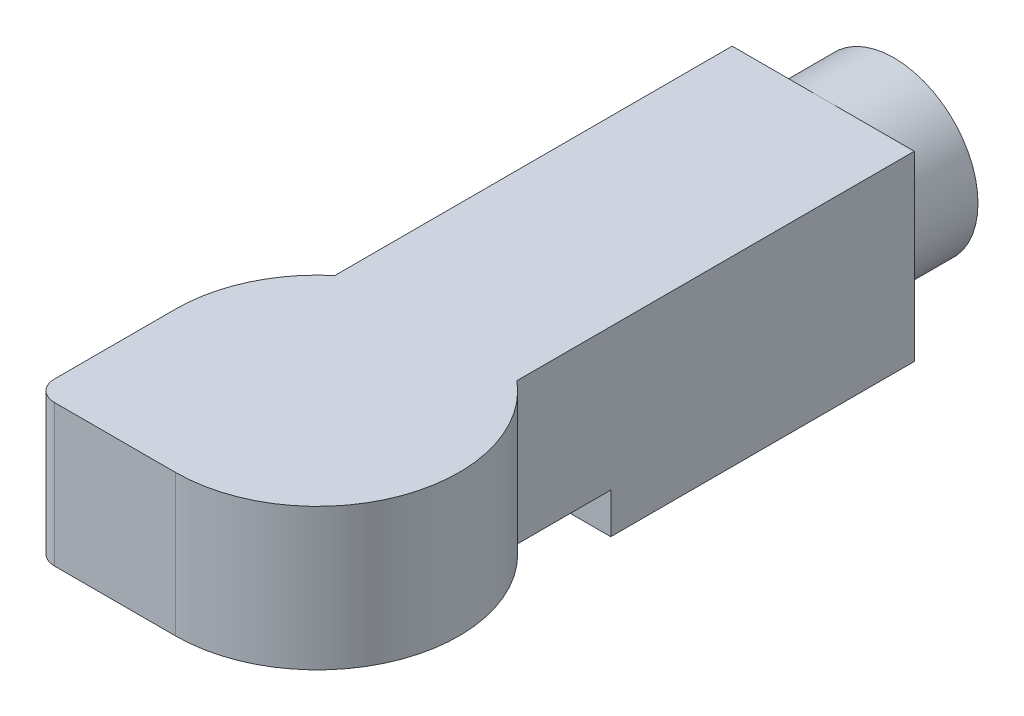
ISO-10303-21;
HEADER;
FILE_DESCRIPTION(('STEP AP214'),'2;1');
FILE_NAME('part.step','',(''),(''),'','','');
FILE_SCHEMA(('AUTOMOTIVE_DESIGN { 1 0 10303 214 1 1 1 1 }'));
ENDSEC;
DATA;
#1=APPLICATION_CONTEXT('core data for automotive mechanical design processes');
#2=APPLICATION_PROTOCOL_DEFINITION('international standard','automotive_design',2000,#1);
#3=PRODUCT_CONTEXT('',#1,'mechanical');
#4=PRODUCT('Part','Part','',(#3));
#5=PRODUCT_RELATED_PRODUCT_CATEGORY('part','',(#4));
#6=PRODUCT_DEFINITION_FORMATION('','',#4);
#7=PRODUCT_DEFINITION_CONTEXT('part definition',#1,'design');
#8=PRODUCT_DEFINITION('design','',#6,#7);
#9=PRODUCT_DEFINITION_SHAPE('','',#8);
#10=(LENGTH_UNIT() NAMED_UNIT(*) SI_UNIT(.MILLI.,.METRE.));
#11=(NAMED_UNIT(*) PLANE_ANGLE_UNIT() SI_UNIT($,.RADIAN.));
#12=(NAMED_UNIT(*) SI_UNIT($,.STERADIAN.) SOLID_ANGLE_UNIT());
#13=UNCERTAINTY_MEASURE_WITH_UNIT(LENGTH_MEASURE(1.E-05),#10,'distance_accuracy_value','');
#14=(GEOMETRIC_REPRESENTATION_CONTEXT(3) GLOBAL_UNCERTAINTY_ASSIGNED_CONTEXT((#13)) GLOBAL_UNIT_ASSIGNED_CONTEXT((#10,
#11,#12)) REPRESENTATION_CONTEXT('',''));
#15=CARTESIAN_POINT('',(0.,0.,0.));
#16=DIRECTION('',(0.,0.,1.));
#17=DIRECTION('',(1.,0.,0.));
#18=AXIS2_PLACEMENT_3D('',#15,#16,#17);
#19=CARTESIAN_POINT('',(45.,20.,-75.));
#20=DIRECTION('',(-1.,0.,0.));
#21=DIRECTION('',(0.,0.,1.));
#22=AXIS2_PLACEMENT_3D('',#19,#20,#21);
#23=PLANE('',#22);
#24=DIRECTION('',(0.,0.,-1.));
#25=VECTOR('',#24,1.);
#26=CARTESIAN_POINT('',(45.,0.,-75.));
#27=LINE('',#26,#25);
#28=CARTESIAN_POINT('',(45.,0.,75.));
#29=VERTEX_POINT('',#28);
#30=CARTESIAN_POINT('',(45.,0.,-75.));
#31=VERTEX_POINT('',#30);
#32=EDGE_CURVE('E171',#29,#31,#27,.T.);
#33=ORIENTED_EDGE('',*,*,#32,.T.);
#34=DIRECTION('',(0.,-1.,0.));
#35=VECTOR('',#34,1.);
#36=CARTESIAN_POINT('',(45.,20.,-75.));
#37=LINE('',#36,#35);
#38=CARTESIAN_POINT('',(45.,90.,-75.));
#39=VERTEX_POINT('',#38);
#40=EDGE_CURVE('E190',#39,#31,#37,.T.);
#41=ORIENTED_EDGE('',*,*,#40,.F.);
#42=DIRECTION('',(0.,0.,-1.));
#43=VECTOR('',#42,1.);
#44=CARTESIAN_POINT('',(45.,90.,-75.));
#45=LINE('',#44,#43);
#46=CARTESIAN_POINT('',(45.0000000000001,90.,121.380973526182));
#47=VERTEX_POINT('',#46);
#48=EDGE_CURVE('E129',#47,#39,#45,.T.);
#49=ORIENTED_EDGE('',*,*,#48,.F.);
#50=DIRECTION('',(0.,-1.,0.));
#51=VECTOR('',#50,1.);
#52=CARTESIAN_POINT('',(45.0000000000001,90.,121.380973526182));
#53=LINE('',#52,#51);
#54=CARTESIAN_POINT('',(45.0000000000001,20.,121.380973526182));
#55=VERTEX_POINT('',#54);
#56=EDGE_CURVE('E133',#47,#55,#53,.T.);
#57=ORIENTED_EDGE('',*,*,#56,.T.);
#58=DIRECTION('',(0.,0.,-1.));
#59=VECTOR('',#58,1.);
#60=CARTESIAN_POINT('',(45.,20.,-75.));
#61=LINE('',#60,#59);
#62=CARTESIAN_POINT('',(45.,20.,75.));
#63=VERTEX_POINT('',#62);
#64=EDGE_CURVE('E156',#55,#63,#61,.T.);
#65=ORIENTED_EDGE('',*,*,#64,.T.);
#66=DIRECTION('',(0.,-1.,0.));
#67=VECTOR('',#66,1.);
#68=CARTESIAN_POINT('',(45.,20.,75.));
#69=LINE('',#68,#67);
#70=EDGE_CURVE('E175',#63,#29,#69,.T.);
#71=ORIENTED_EDGE('',*,*,#70,.T.);
#72=EDGE_LOOP('',(#33,#41,#49,#57,#65,#71));
#73=FACE_BOUND('',#72,.T.);
#74=ADVANCED_FACE('F42',(#73),#23,.F.);
#75=CARTESIAN_POINT('',(-45.,20.,-75.));
#76=DIRECTION('',(0.,0.,1.));
#77=DIRECTION('',(1.,0.,0.));
#78=AXIS2_PLACEMENT_3D('',#75,#76,#77);
#79=PLANE('',#78);
#80=DIRECTION('',(-1.,0.,0.));
#81=VECTOR('',#80,1.);
#82=CARTESIAN_POINT('',(-45.,90.,-75.));
#83=LINE('',#82,#81);
#84=CARTESIAN_POINT('',(0.,90.,-75.));
#85=VERTEX_POINT('',#84);
#86=CARTESIAN_POINT('',(-45.,90.,-75.));
#87=VERTEX_POINT('',#86);
#88=EDGE_CURVE('E126',#85,#87,#83,.T.);
#89=ORIENTED_EDGE('',*,*,#88,.F.);
#90=CARTESIAN_POINT('',(0.,48.5,-75.));
#91=DIRECTION('',(0.,0.,-1.));
#92=DIRECTION('',(-1.,0.,0.));
#93=AXIS2_PLACEMENT_3D('',#90,#91,#92);
#94=CIRCLE('',#93,41.5);
#95=EDGE_CURVE('E137',#85,#85,#94,.T.);
#96=ORIENTED_EDGE('',*,*,#95,.F.);
#97=EDGE_CURVE('E122',#39,#85,#83,.T.);
#98=ORIENTED_EDGE('',*,*,#97,.F.);
#99=ORIENTED_EDGE('',*,*,#40,.T.);
#100=DIRECTION('',(-1.,0.,0.));
#101=VECTOR('',#100,1.);
#102=CARTESIAN_POINT('',(-45.,0.,-75.));
#103=LINE('',#102,#101);
#104=CARTESIAN_POINT('',(-45.,0.,-75.));
#105=VERTEX_POINT('',#104);
#106=EDGE_CURVE('E179',#31,#105,#103,.T.);
#107=ORIENTED_EDGE('',*,*,#106,.T.);
#108=DIRECTION('',(0.,-1.,0.));
#109=VECTOR('',#108,1.);
#110=CARTESIAN_POINT('',(-45.,20.,-75.));
#111=LINE('',#110,#109);
#112=EDGE_CURVE('E139',#87,#105,#111,.T.);
#113=ORIENTED_EDGE('',*,*,#112,.F.);
#114=EDGE_LOOP('',(#89,#96,#98,#99,#107,#113));
#115=FACE_BOUND('',#114,.T.);
#116=ADVANCED_FACE('F135',(#115),#79,.F.);
#117=CARTESIAN_POINT('',(-45.,20.,-75.));
#118=DIRECTION('',(1.,0.,0.));
#119=DIRECTION('',(0.,0.,-1.));
#120=AXIS2_PLACEMENT_3D('',#117,#118,#119);
#121=PLANE('',#120);
#122=DIRECTION('',(0.,0.,1.));
#123=VECTOR('',#122,1.);
#124=CARTESIAN_POINT('',(-45.,0.,-75.));
#125=LINE('',#124,#123);
#126=CARTESIAN_POINT('',(-45.,0.,75.));
#127=VERTEX_POINT('',#126);
#128=EDGE_CURVE('E181',#105,#127,#125,.T.);
#129=ORIENTED_EDGE('',*,*,#128,.T.);
#130=DIRECTION('',(0.,-1.,0.));
#131=VECTOR('',#130,1.);
#132=CARTESIAN_POINT('',(-45.,20.,75.));
#133=LINE('',#132,#131);
#134=CARTESIAN_POINT('',(-45.,20.,75.));
#135=VERTEX_POINT('',#134);
#136=EDGE_CURVE('E186',#135,#127,#133,.T.);
#137=ORIENTED_EDGE('',*,*,#136,.F.);
#138=DIRECTION('',(0.,0.,1.));
#139=VECTOR('',#138,1.);
#140=CARTESIAN_POINT('',(-45.,20.,-75.));
#141=LINE('',#140,#139);
#142=CARTESIAN_POINT('',(-44.9999999999999,20.,121.380973526182));
#143=VERTEX_POINT('',#142);
#144=EDGE_CURVE('E145',#135,#143,#141,.T.);
#145=ORIENTED_EDGE('',*,*,#144,.T.);
#146=DIRECTION('',(0.,-1.,0.));
#147=VECTOR('',#146,1.);
#148=CARTESIAN_POINT('',(-44.9999999999999,90.,121.380973526182));
#149=LINE('',#148,#147);
#150=CARTESIAN_POINT('',(-44.9999999999999,90.,121.380973526182));
#151=VERTEX_POINT('',#150);
#152=EDGE_CURVE('E168',#151,#143,#149,.T.);
#153=ORIENTED_EDGE('',*,*,#152,.F.);
#154=DIRECTION('',(0.,0.,1.));
#155=VECTOR('',#154,1.);
#156=CARTESIAN_POINT('',(-45.,90.,-75.));
#157=LINE('',#156,#155);
#158=EDGE_CURVE('E159',#87,#151,#157,.T.);
#159=ORIENTED_EDGE('',*,*,#158,.F.);
#160=ORIENTED_EDGE('',*,*,#112,.T.);
#161=EDGE_LOOP('',(#129,#137,#145,#153,#159,#160));
#162=FACE_BOUND('',#161,.T.);
#163=ADVANCED_FACE('F215',(#162),#121,.F.);
#164=CARTESIAN_POINT('',(-45.,20.,75.));
#165=DIRECTION('',(0.,0.,-1.));
#166=DIRECTION('',(-1.,0.,0.));
#167=AXIS2_PLACEMENT_3D('',#164,#165,#166);
#168=PLANE('',#167);
#169=DIRECTION('',(1.,0.,0.));
#170=VECTOR('',#169,1.);
#171=CARTESIAN_POINT('',(-45.,0.,75.));
#172=LINE('',#171,#170);
#173=EDGE_CURVE('E176',#127,#29,#172,.T.);
#174=ORIENTED_EDGE('',*,*,#173,.T.);
#175=ORIENTED_EDGE('',*,*,#70,.F.);
#176=DIRECTION('',(1.,0.,0.));
#177=VECTOR('',#176,1.);
#178=CARTESIAN_POINT('',(-45.,20.,75.));
#179=LINE('',#178,#177);
#180=EDGE_CURVE('E172',#135,#63,#179,.T.);
#181=ORIENTED_EDGE('',*,*,#180,.F.);
#182=ORIENTED_EDGE('',*,*,#136,.T.);
#183=EDGE_LOOP('',(#174,#175,#181,#182));
#184=FACE_BOUND('',#183,.T.);
#185=ADVANCED_FACE('F220',(#184),#168,.F.);
#186=CARTESIAN_POINT('',(0.,0.,0.));
#187=DIRECTION('',(0.,1.,0.));
#188=DIRECTION('',(0.,0.,1.));
#189=AXIS2_PLACEMENT_3D('',#186,#187,#188);
#190=PLANE('',#189);
#191=ORIENTED_EDGE('',*,*,#32,.F.);
#192=ORIENTED_EDGE('',*,*,#173,.F.);
#193=ORIENTED_EDGE('',*,*,#128,.F.);
#194=ORIENTED_EDGE('',*,*,#106,.F.);
#195=EDGE_LOOP('',(#191,#192,#193,#194));
#196=FACE_BOUND('',#195,.T.);
#197=ADVANCED_FACE('F218',(#196),#190,.F.);
#198=CARTESIAN_POINT('',(0.,20.,175.));
#199=DIRECTION('',(0.,1.,0.));
#200=DIRECTION('',(0.,0.,1.));
#201=AXIS2_PLACEMENT_3D('',#198,#199,#200);
#202=PLANE('',#201);
#203=DIRECTION('',(1.,0.,0.));
#204=VECTOR('',#203,1.);
#205=CARTESIAN_POINT('',(-69.9999999999999,20.,245.));
#206=LINE('',#205,#204);
#207=CARTESIAN_POINT('',(-59.9999999999999,20.,245.));
#208=VERTEX_POINT('',#207);
#209=CARTESIAN_POINT('',(0.,20.,245.));
#210=VERTEX_POINT('',#209);
#211=EDGE_CURVE('E152',#208,#210,#206,.T.);
#212=ORIENTED_EDGE('',*,*,#211,.F.);
#213=CARTESIAN_POINT('',(-59.9999999999999,20.,235.));
#214=DIRECTION('',(0.,1.,0.));
#215=DIRECTION('',(0.,0.,1.));
#216=AXIS2_PLACEMENT_3D('',#213,#214,#215);
#217=CIRCLE('',#216,10.);
#218=CARTESIAN_POINT('',(-69.9999999999999,20.,235.));
#219=VERTEX_POINT('',#218);
#220=EDGE_CURVE('E64',#208,#219,#217,.F.);
#221=ORIENTED_EDGE('',*,*,#220,.T.);
#222=DIRECTION('',(0.,0.,1.));
#223=VECTOR('',#222,1.);
#224=CARTESIAN_POINT('',(-69.9999999999999,20.,175.));
#225=LINE('',#224,#223);
#226=CARTESIAN_POINT('',(-69.9999999999999,20.,175.));
#227=VERTEX_POINT('',#226);
#228=EDGE_CURVE('E150',#227,#219,#225,.T.);
#229=ORIENTED_EDGE('',*,*,#228,.F.);
#230=CARTESIAN_POINT('',(0.,20.,175.));
#231=DIRECTION('',(0.,1.,0.));
#232=DIRECTION('',(0.,0.,1.));
#233=AXIS2_PLACEMENT_3D('',#230,#231,#232);
#234=CIRCLE('',#233,70.);
#235=EDGE_CURVE('E147',#143,#227,#234,.T.);
#236=ORIENTED_EDGE('',*,*,#235,.F.);
#237=ORIENTED_EDGE('',*,*,#144,.F.);
#238=ORIENTED_EDGE('',*,*,#180,.T.);
#239=ORIENTED_EDGE('',*,*,#64,.F.);
#240=CARTESIAN_POINT('',(0.,20.,175.));
#241=DIRECTION('',(0.,1.,0.));
#242=DIRECTION('',(0.,0.,1.));
#243=AXIS2_PLACEMENT_3D('',#240,#241,#242);
#244=CIRCLE('',#243,70.);
#245=EDGE_CURVE('E154',#210,#55,#244,.T.);
#246=ORIENTED_EDGE('',*,*,#245,.F.);
#247=EDGE_LOOP('',(#212,#221,#229,#236,#237,#238,#239,#246));
#248=FACE_BOUND('',#247,.T.);
#249=ADVANCED_FACE('F204',(#248),#202,.F.);
#250=CARTESIAN_POINT('',(0.,90.,175.));
#251=DIRECTION('',(0.,-1.,0.));
#252=DIRECTION('',(0.,0.,-1.));
#253=AXIS2_PLACEMENT_3D('',#250,#251,#252);
#254=CYLINDRICAL_SURFACE('',#253,70.);
#255=ORIENTED_EDGE('',*,*,#235,.T.);
#256=DIRECTION('',(0.,-1.,0.));
#257=VECTOR('',#256,1.);
#258=CARTESIAN_POINT('',(-69.9999999999999,90.,175.));
#259=LINE('',#258,#257);
#260=CARTESIAN_POINT('',(-69.9999999999999,90.,175.));
#261=VERTEX_POINT('',#260);
#262=EDGE_CURVE('E165',#261,#227,#259,.T.);
#263=ORIENTED_EDGE('',*,*,#262,.F.);
#264=CARTESIAN_POINT('',(0.,90.,175.));
#265=DIRECTION('',(0.,1.,0.));
#266=DIRECTION('',(0.,0.,1.));
#267=AXIS2_PLACEMENT_3D('',#264,#265,#266);
#268=CIRCLE('',#267,70.);
#269=EDGE_CURVE('E227',#151,#261,#268,.T.);
#270=ORIENTED_EDGE('',*,*,#269,.F.);
#271=ORIENTED_EDGE('',*,*,#152,.T.);
#272=EDGE_LOOP('',(#255,#263,#270,#271));
#273=FACE_BOUND('',#272,.T.);
#274=ADVANCED_FACE('F226',(#273),#254,.T.);
#275=CARTESIAN_POINT('',(-69.9999999999999,90.,175.));
#276=DIRECTION('',(1.,0.,0.));
#277=DIRECTION('',(0.,0.,-1.));
#278=AXIS2_PLACEMENT_3D('',#275,#276,#277);
#279=PLANE('',#278);
#280=ORIENTED_EDGE('',*,*,#228,.T.);
#281=DIRECTION('',(0.,-1.,0.));
#282=VECTOR('',#281,1.);
#283=CARTESIAN_POINT('',(-69.9999999999999,90.,235.));
#284=LINE('',#283,#282);
#285=CARTESIAN_POINT('',(-69.9999999999999,90.,235.));
#286=VERTEX_POINT('',#285);
#287=EDGE_CURVE('E50',#219,#286,#284,.F.);
#288=ORIENTED_EDGE('',*,*,#287,.T.);
#289=DIRECTION('',(0.,0.,1.));
#290=VECTOR('',#289,1.);
#291=CARTESIAN_POINT('',(-69.9999999999999,90.,175.));
#292=LINE('',#291,#290);
#293=EDGE_CURVE('E228',#261,#286,#292,.T.);
#294=ORIENTED_EDGE('',*,*,#293,.F.);
#295=ORIENTED_EDGE('',*,*,#262,.T.);
#296=EDGE_LOOP('',(#280,#288,#294,#295));
#297=FACE_BOUND('',#296,.T.);
#298=ADVANCED_FACE('F260',(#297),#279,.F.);
#299=CARTESIAN_POINT('',(-69.9999999999999,90.,245.));
#300=DIRECTION('',(0.,0.,-1.));
#301=DIRECTION('',(-1.,0.,0.));
#302=AXIS2_PLACEMENT_3D('',#299,#300,#301);
#303=PLANE('',#302);
#304=DIRECTION('',(1.,0.,0.));
#305=VECTOR('',#304,1.);
#306=CARTESIAN_POINT('',(-69.9999999999999,90.,245.));
#307=LINE('',#306,#305);
#308=CARTESIAN_POINT('',(-59.9999999999999,90.,245.));
#309=VERTEX_POINT('',#308);
#310=CARTESIAN_POINT('',(0.,90.,245.));
#311=VERTEX_POINT('',#310);
#312=EDGE_CURVE('E200',#309,#311,#307,.T.);
#313=ORIENTED_EDGE('',*,*,#312,.F.);
#314=DIRECTION('',(0.,-1.,0.));
#315=VECTOR('',#314,1.);
#316=CARTESIAN_POINT('',(-59.9999999999999,90.,245.));
#317=LINE('',#316,#315);
#318=EDGE_CURVE('E192',#309,#208,#317,.T.);
#319=ORIENTED_EDGE('',*,*,#318,.T.);
#320=ORIENTED_EDGE('',*,*,#211,.T.);
#321=DIRECTION('',(0.,-1.,0.));
#322=VECTOR('',#321,1.);
#323=CARTESIAN_POINT('',(0.,90.,245.));
#324=LINE('',#323,#322);
#325=EDGE_CURVE('E162',#311,#210,#324,.T.);
#326=ORIENTED_EDGE('',*,*,#325,.F.);
#327=EDGE_LOOP('',(#313,#319,#320,#326));
#328=FACE_BOUND('',#327,.T.);
#329=ADVANCED_FACE('F198',(#328),#303,.F.);
#330=CARTESIAN_POINT('',(0.,90.,175.));
#331=DIRECTION('',(0.,-1.,0.));
#332=DIRECTION('',(0.,0.,-1.));
#333=AXIS2_PLACEMENT_3D('',#330,#331,#332);
#334=CYLINDRICAL_SURFACE('',#333,70.);
#335=ORIENTED_EDGE('',*,*,#245,.T.);
#336=ORIENTED_EDGE('',*,*,#56,.F.);
#337=CARTESIAN_POINT('',(0.,90.,175.));
#338=DIRECTION('',(0.,1.,0.));
#339=DIRECTION('',(0.,0.,1.));
#340=AXIS2_PLACEMENT_3D('',#337,#338,#339);
#341=CIRCLE('',#340,70.);
#342=EDGE_CURVE('E141',#311,#47,#341,.T.);
#343=ORIENTED_EDGE('',*,*,#342,.F.);
#344=ORIENTED_EDGE('',*,*,#325,.T.);
#345=EDGE_LOOP('',(#335,#336,#343,#344));
#346=FACE_BOUND('',#345,.T.);
#347=ADVANCED_FACE('F208',(#346),#334,.T.);
#348=CARTESIAN_POINT('',(0.,90.,175.));
#349=DIRECTION('',(0.,1.,0.));
#350=DIRECTION('',(0.,0.,1.));
#351=AXIS2_PLACEMENT_3D('',#348,#349,#350);
#352=PLANE('',#351);
#353=ORIENTED_EDGE('',*,*,#293,.T.);
#354=CARTESIAN_POINT('',(-59.9999999999999,90.,235.));
#355=DIRECTION('',(0.,1.,0.));
#356=DIRECTION('',(0.,0.,1.));
#357=AXIS2_PLACEMENT_3D('',#354,#355,#356);
#358=CIRCLE('',#357,10.);
#359=EDGE_CURVE('E11',#286,#309,#358,.T.);
#360=ORIENTED_EDGE('',*,*,#359,.T.);
#361=ORIENTED_EDGE('',*,*,#312,.T.);
#362=ORIENTED_EDGE('',*,*,#342,.T.);
#363=ORIENTED_EDGE('',*,*,#48,.T.);
#364=ORIENTED_EDGE('',*,*,#97,.T.);
#365=ORIENTED_EDGE('',*,*,#88,.T.);
#366=ORIENTED_EDGE('',*,*,#158,.T.);
#367=ORIENTED_EDGE('',*,*,#269,.T.);
#368=EDGE_LOOP('',(#353,#360,#361,#362,#363,#364,#365,#366,#367));
#369=FACE_BOUND('',#368,.T.);
#370=ADVANCED_FACE('F124',(#369),#352,.T.);
#371=CARTESIAN_POINT('',(-59.9999999999999,90.,235.));
#372=DIRECTION('',(0.,-1.,0.));
#373=DIRECTION('',(0.,0.,-1.));
#374=AXIS2_PLACEMENT_3D('',#371,#372,#373);
#375=CYLINDRICAL_SURFACE('',#374,10.);
#376=ORIENTED_EDGE('',*,*,#359,.F.);
#377=ORIENTED_EDGE('',*,*,#287,.F.);
#378=ORIENTED_EDGE('',*,*,#220,.F.);
#379=ORIENTED_EDGE('',*,*,#318,.F.);
#380=EDGE_LOOP('',(#376,#377,#378,#379));
#381=FACE_BOUND('',#380,.T.);
#382=ADVANCED_FACE('F44',(#381),#375,.T.);
#383=CARTESIAN_POINT('',(0.,48.5,-110.));
#384=DIRECTION('',(0.,0.,1.));
#385=DIRECTION('',(1.,0.,0.));
#386=AXIS2_PLACEMENT_3D('',#383,#384,#385);
#387=CYLINDRICAL_SURFACE('',#386,41.5);
#388=CARTESIAN_POINT('',(0.,48.5,-110.));
#389=DIRECTION('',(0.,0.,-1.));
#390=DIRECTION('',(-1.,0.,0.));
#391=AXIS2_PLACEMENT_3D('',#388,#389,#390);
#392=CIRCLE('',#391,41.5);
#393=CARTESIAN_POINT('',(-41.4999999999999,48.5,-110.));
#394=VERTEX_POINT('',#393);
#395=EDGE_CURVE('E148',#394,#394,#392,.T.);
#396=ORIENTED_EDGE('',*,*,#395,.F.);
#397=EDGE_LOOP('',(#396));
#398=FACE_BOUND('',#397,.T.);
#399=ORIENTED_EDGE('',*,*,#95,.T.);
#400=EDGE_LOOP('',(#399));
#401=FACE_BOUND('',#400,.T.);
#402=ADVANCED_FACE('F236',(#398,#401),#387,.T.);
#403=CARTESIAN_POINT('',(0.,48.5,-110.));
#404=DIRECTION('',(0.,0.,-1.));
#405=DIRECTION('',(-1.,0.,0.));
#406=AXIS2_PLACEMENT_3D('',#403,#404,#405);
#407=PLANE('',#406);
#408=ORIENTED_EDGE('',*,*,#395,.T.);
#409=EDGE_LOOP('',(#408));
#410=FACE_BOUND('',#409,.T.);
#411=ADVANCED_FACE('F242',(#410),#407,.T.);
#412=CLOSED_SHELL('',(#74,#116,#163,#185,#197,#249,#274,#298,#329,#347,#370,#382,#402,#411));
#413=MANIFOLD_SOLID_BREP('B2',#412);
#414=ADVANCED_BREP_SHAPE_REPRESENTATION('',(#18,#413),#14);
#415=SHAPE_DEFINITION_REPRESENTATION(#9,#414);
ENDSEC;
END-ISO-10303-21;
